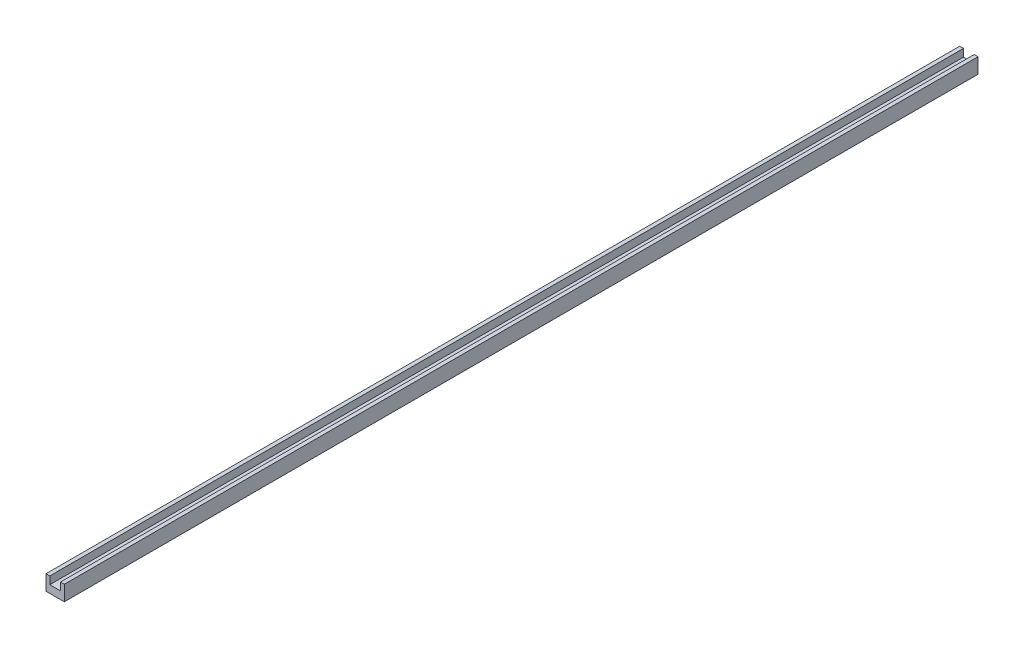
ISO-10303-21;
HEADER;
FILE_DESCRIPTION(('STEP AP214'),'2;1');
FILE_NAME('part.step','',(''),(''),'','','');
FILE_SCHEMA(('AUTOMOTIVE_DESIGN { 1 0 10303 214 1 1 1 1 }'));
ENDSEC;
DATA;
#1=APPLICATION_CONTEXT('core data for automotive mechanical design processes');
#2=APPLICATION_PROTOCOL_DEFINITION('international standard','automotive_design',2000,#1);
#3=PRODUCT_CONTEXT('',#1,'mechanical');
#4=PRODUCT('Part','Part','',(#3));
#5=PRODUCT_RELATED_PRODUCT_CATEGORY('part','',(#4));
#6=PRODUCT_DEFINITION_FORMATION('','',#4);
#7=PRODUCT_DEFINITION_CONTEXT('part definition',#1,'design');
#8=PRODUCT_DEFINITION('design','',#6,#7);
#9=PRODUCT_DEFINITION_SHAPE('','',#8);
#10=(LENGTH_UNIT() NAMED_UNIT(*) SI_UNIT(.MILLI.,.METRE.));
#11=(NAMED_UNIT(*) PLANE_ANGLE_UNIT() SI_UNIT($,.RADIAN.));
#12=(NAMED_UNIT(*) SI_UNIT($,.STERADIAN.) SOLID_ANGLE_UNIT());
#13=UNCERTAINTY_MEASURE_WITH_UNIT(LENGTH_MEASURE(1.E-05),#10,'distance_accuracy_value','');
#14=(GEOMETRIC_REPRESENTATION_CONTEXT(3) GLOBAL_UNCERTAINTY_ASSIGNED_CONTEXT((#13)) GLOBAL_UNIT_ASSIGNED_CONTEXT((#10,
#11,#12)) REPRESENTATION_CONTEXT('',''));
#15=CARTESIAN_POINT('',(0.,0.,0.));
#16=DIRECTION('',(0.,0.,1.));
#17=DIRECTION('',(1.,0.,0.));
#18=AXIS2_PLACEMENT_3D('',#15,#16,#17);
#19=CARTESIAN_POINT('',(0.,10.,600.));
#20=DIRECTION('',(0.,-1.,0.));
#21=DIRECTION('',(0.,0.,-1.));
#22=AXIS2_PLACEMENT_3D('',#19,#20,#21);
#23=PLANE('',#22);
#24=DIRECTION('',(0.,0.,1.));
#25=VECTOR('',#24,1.);
#26=CARTESIAN_POINT('',(9.5,10.,0.));
#27=LINE('',#26,#25);
#28=CARTESIAN_POINT('',(9.5,10.,0.));
#29=VERTEX_POINT('',#28);
#30=CARTESIAN_POINT('',(9.5,10.,600.));
#31=VERTEX_POINT('',#30);
#32=EDGE_CURVE('E108',#29,#31,#27,.T.);
#33=ORIENTED_EDGE('',*,*,#32,.T.);
#34=DIRECTION('',(-1.,0.,0.));
#35=VECTOR('',#34,1.);
#36=CARTESIAN_POINT('',(0.,10.,600.));
#37=LINE('',#36,#35);
#38=CARTESIAN_POINT('',(12.,10.,600.));
#39=VERTEX_POINT('',#38);
#40=EDGE_CURVE('E141',#39,#31,#37,.T.);
#41=ORIENTED_EDGE('',*,*,#40,.F.);
#42=DIRECTION('',(0.,0.,-1.));
#43=VECTOR('',#42,1.);
#44=CARTESIAN_POINT('',(12.,10.,600.));
#45=LINE('',#44,#43);
#46=CARTESIAN_POINT('',(12.,10.,0.));
#47=VERTEX_POINT('',#46);
#48=EDGE_CURVE('E131',#39,#47,#45,.T.);
#49=ORIENTED_EDGE('',*,*,#48,.T.);
#50=DIRECTION('',(-1.,0.,0.));
#51=VECTOR('',#50,1.);
#52=CARTESIAN_POINT('',(0.,10.,0.));
#53=LINE('',#52,#51);
#54=EDGE_CURVE('E124',#47,#29,#53,.T.);
#55=ORIENTED_EDGE('',*,*,#54,.T.);
#56=EDGE_LOOP('',(#33,#41,#49,#55));
#57=FACE_BOUND('',#56,.T.);
#58=ADVANCED_FACE('F33',(#57),#23,.F.);
#59=CARTESIAN_POINT('',(0.,0.,600.));
#60=DIRECTION('',(0.,0.,-1.));
#61=DIRECTION('',(-1.,0.,0.));
#62=AXIS2_PLACEMENT_3D('',#59,#60,#61);
#63=PLANE('',#62);
#64=DIRECTION('',(0.,-1.,0.));
#65=VECTOR('',#64,1.);
#66=CARTESIAN_POINT('',(9.5,0.,600.));
#67=LINE('',#66,#65);
#68=CARTESIAN_POINT('',(9.5,5.,600.));
#69=VERTEX_POINT('',#68);
#70=EDGE_CURVE('E113',#31,#69,#67,.T.);
#71=ORIENTED_EDGE('',*,*,#70,.T.);
#72=DIRECTION('',(1.,0.,0.));
#73=VECTOR('',#72,1.);
#74=CARTESIAN_POINT('',(0.,5.,600.));
#75=LINE('',#74,#73);
#76=CARTESIAN_POINT('',(2.5,5.,600.));
#77=VERTEX_POINT('',#76);
#78=EDGE_CURVE('E127',#77,#69,#75,.T.);
#79=ORIENTED_EDGE('',*,*,#78,.F.);
#80=DIRECTION('',(0.,-1.,0.));
#81=VECTOR('',#80,1.);
#82=CARTESIAN_POINT('',(2.5,0.,600.));
#83=LINE('',#82,#81);
#84=CARTESIAN_POINT('',(2.5,10.,600.));
#85=VERTEX_POINT('',#84);
#86=EDGE_CURVE('E163',#85,#77,#83,.T.);
#87=ORIENTED_EDGE('',*,*,#86,.F.);
#88=CARTESIAN_POINT('',(0.,10.,600.));
#89=VERTEX_POINT('',#88);
#90=EDGE_CURVE('E57',#85,#89,#37,.T.);
#91=ORIENTED_EDGE('',*,*,#90,.T.);
#92=DIRECTION('',(0.,-1.,0.));
#93=VECTOR('',#92,1.);
#94=CARTESIAN_POINT('',(0.,0.,600.));
#95=LINE('',#94,#93);
#96=CARTESIAN_POINT('',(0.,0.,600.));
#97=VERTEX_POINT('',#96);
#98=EDGE_CURVE('E132',#89,#97,#95,.T.);
#99=ORIENTED_EDGE('',*,*,#98,.T.);
#100=DIRECTION('',(1.,0.,0.));
#101=VECTOR('',#100,1.);
#102=CARTESIAN_POINT('',(0.,0.,600.));
#103=LINE('',#102,#101);
#104=CARTESIAN_POINT('',(12.,0.,600.));
#105=VERTEX_POINT('',#104);
#106=EDGE_CURVE('E86',#97,#105,#103,.T.);
#107=ORIENTED_EDGE('',*,*,#106,.T.);
#108=DIRECTION('',(0.,1.,0.));
#109=VECTOR('',#108,1.);
#110=CARTESIAN_POINT('',(12.,0.,600.));
#111=LINE('',#110,#109);
#112=EDGE_CURVE('E146',#105,#39,#111,.T.);
#113=ORIENTED_EDGE('',*,*,#112,.T.);
#114=ORIENTED_EDGE('',*,*,#40,.T.);
#115=EDGE_LOOP('',(#71,#79,#87,#91,#99,#107,#113,#114));
#116=FACE_BOUND('',#115,.T.);
#117=ADVANCED_FACE('F174',(#116),#63,.F.);
#118=CARTESIAN_POINT('',(0.,0.,0.));
#119=DIRECTION('',(0.,0.,-1.));
#120=DIRECTION('',(-1.,0.,0.));
#121=AXIS2_PLACEMENT_3D('',#118,#119,#120);
#122=PLANE('',#121);
#123=DIRECTION('',(1.,0.,0.));
#124=VECTOR('',#123,1.);
#125=CARTESIAN_POINT('',(0.,5.,0.));
#126=LINE('',#125,#124);
#127=CARTESIAN_POINT('',(2.5,5.,0.));
#128=VERTEX_POINT('',#127);
#129=CARTESIAN_POINT('',(9.5,5.,0.));
#130=VERTEX_POINT('',#129);
#131=EDGE_CURVE('E48',#128,#130,#126,.T.);
#132=ORIENTED_EDGE('',*,*,#131,.T.);
#133=DIRECTION('',(0.,-1.,0.));
#134=VECTOR('',#133,1.);
#135=CARTESIAN_POINT('',(9.5,0.,0.));
#136=LINE('',#135,#134);
#137=EDGE_CURVE('E111',#29,#130,#136,.T.);
#138=ORIENTED_EDGE('',*,*,#137,.F.);
#139=ORIENTED_EDGE('',*,*,#54,.F.);
#140=DIRECTION('',(0.,1.,0.));
#141=VECTOR('',#140,1.);
#142=CARTESIAN_POINT('',(12.,0.,0.));
#143=LINE('',#142,#141);
#144=CARTESIAN_POINT('',(12.,0.,0.));
#145=VERTEX_POINT('',#144);
#146=EDGE_CURVE('E135',#145,#47,#143,.T.);
#147=ORIENTED_EDGE('',*,*,#146,.F.);
#148=DIRECTION('',(1.,0.,0.));
#149=VECTOR('',#148,1.);
#150=CARTESIAN_POINT('',(0.,0.,0.));
#151=LINE('',#150,#149);
#152=CARTESIAN_POINT('',(0.,0.,0.));
#153=VERTEX_POINT('',#152);
#154=EDGE_CURVE('E148',#153,#145,#151,.T.);
#155=ORIENTED_EDGE('',*,*,#154,.F.);
#156=DIRECTION('',(0.,-1.,0.));
#157=VECTOR('',#156,1.);
#158=CARTESIAN_POINT('',(0.,0.,0.));
#159=LINE('',#158,#157);
#160=CARTESIAN_POINT('',(0.,10.,0.));
#161=VERTEX_POINT('',#160);
#162=EDGE_CURVE('E149',#161,#153,#159,.T.);
#163=ORIENTED_EDGE('',*,*,#162,.F.);
#164=CARTESIAN_POINT('',(2.5,10.,0.));
#165=VERTEX_POINT('',#164);
#166=EDGE_CURVE('E79',#165,#161,#53,.T.);
#167=ORIENTED_EDGE('',*,*,#166,.F.);
#168=DIRECTION('',(0.,-1.,0.));
#169=VECTOR('',#168,1.);
#170=CARTESIAN_POINT('',(2.5,0.,0.));
#171=LINE('',#170,#169);
#172=EDGE_CURVE('E126',#165,#128,#171,.T.);
#173=ORIENTED_EDGE('',*,*,#172,.T.);
#174=EDGE_LOOP('',(#132,#138,#139,#147,#155,#163,#167,#173));
#175=FACE_BOUND('',#174,.T.);
#176=ADVANCED_FACE('F122',(#175),#122,.T.);
#177=CARTESIAN_POINT('',(0.,0.,600.));
#178=DIRECTION('',(1.,0.,0.));
#179=DIRECTION('',(0.,1.,0.));
#180=AXIS2_PLACEMENT_3D('',#177,#178,#179);
#181=PLANE('',#180);
#182=ORIENTED_EDGE('',*,*,#162,.T.);
#183=DIRECTION('',(0.,0.,-1.));
#184=VECTOR('',#183,1.);
#185=CARTESIAN_POINT('',(0.,0.,600.));
#186=LINE('',#185,#184);
#187=EDGE_CURVE('E11',#97,#153,#186,.T.);
#188=ORIENTED_EDGE('',*,*,#187,.F.);
#189=ORIENTED_EDGE('',*,*,#98,.F.);
#190=DIRECTION('',(0.,0.,-1.));
#191=VECTOR('',#190,1.);
#192=CARTESIAN_POINT('',(0.,10.,600.));
#193=LINE('',#192,#191);
#194=EDGE_CURVE('E139',#89,#161,#193,.T.);
#195=ORIENTED_EDGE('',*,*,#194,.T.);
#196=EDGE_LOOP('',(#182,#188,#189,#195));
#197=FACE_BOUND('',#196,.T.);
#198=ADVANCED_FACE('F35',(#197),#181,.F.);
#199=CARTESIAN_POINT('',(0.,0.,600.));
#200=DIRECTION('',(0.,1.,0.));
#201=DIRECTION('',(0.,0.,1.));
#202=AXIS2_PLACEMENT_3D('',#199,#200,#201);
#203=PLANE('',#202);
#204=ORIENTED_EDGE('',*,*,#154,.T.);
#205=DIRECTION('',(0.,0.,-1.));
#206=VECTOR('',#205,1.);
#207=CARTESIAN_POINT('',(12.,0.,600.));
#208=LINE('',#207,#206);
#209=EDGE_CURVE('E41',#105,#145,#208,.T.);
#210=ORIENTED_EDGE('',*,*,#209,.F.);
#211=ORIENTED_EDGE('',*,*,#106,.F.);
#212=ORIENTED_EDGE('',*,*,#187,.T.);
#213=EDGE_LOOP('',(#204,#210,#211,#212));
#214=FACE_BOUND('',#213,.T.);
#215=ADVANCED_FACE('F197',(#214),#203,.F.);
#216=CARTESIAN_POINT('',(12.,0.,600.));
#217=DIRECTION('',(-1.,0.,0.));
#218=DIRECTION('',(0.,0.,1.));
#219=AXIS2_PLACEMENT_3D('',#216,#217,#218);
#220=PLANE('',#219);
#221=ORIENTED_EDGE('',*,*,#146,.T.);
#222=ORIENTED_EDGE('',*,*,#48,.F.);
#223=ORIENTED_EDGE('',*,*,#112,.F.);
#224=ORIENTED_EDGE('',*,*,#209,.T.);
#225=EDGE_LOOP('',(#221,#222,#223,#224));
#226=FACE_BOUND('',#225,.T.);
#227=ADVANCED_FACE('F145',(#226),#220,.F.);
#228=ORIENTED_EDGE('',*,*,#90,.F.);
#229=DIRECTION('',(0.,0.,1.));
#230=VECTOR('',#229,1.);
#231=CARTESIAN_POINT('',(2.5,10.,0.));
#232=LINE('',#231,#230);
#233=EDGE_CURVE('E118',#165,#85,#232,.T.);
#234=ORIENTED_EDGE('',*,*,#233,.F.);
#235=ORIENTED_EDGE('',*,*,#166,.T.);
#236=ORIENTED_EDGE('',*,*,#194,.F.);
#237=EDGE_LOOP('',(#228,#234,#235,#236));
#238=FACE_BOUND('',#237,.T.);
#239=ADVANCED_FACE('F170',(#238),#23,.F.);
#240=CARTESIAN_POINT('',(9.5,0.,0.));
#241=DIRECTION('',(-1.,0.,0.));
#242=DIRECTION('',(0.,0.,1.));
#243=AXIS2_PLACEMENT_3D('',#240,#241,#242);
#244=PLANE('',#243);
#245=ORIENTED_EDGE('',*,*,#70,.F.);
#246=ORIENTED_EDGE('',*,*,#32,.F.);
#247=ORIENTED_EDGE('',*,*,#137,.T.);
#248=DIRECTION('',(0.,0.,1.));
#249=VECTOR('',#248,1.);
#250=CARTESIAN_POINT('',(9.5,5.,0.));
#251=LINE('',#250,#249);
#252=EDGE_CURVE('E151',#130,#69,#251,.T.);
#253=ORIENTED_EDGE('',*,*,#252,.T.);
#254=EDGE_LOOP('',(#245,#246,#247,#253));
#255=FACE_BOUND('',#254,.T.);
#256=ADVANCED_FACE('F110',(#255),#244,.T.);
#257=CARTESIAN_POINT('',(0.,5.,0.));
#258=DIRECTION('',(0.,-1.,0.));
#259=DIRECTION('',(1.,0.,0.));
#260=AXIS2_PLACEMENT_3D('',#257,#258,#259);
#261=PLANE('',#260);
#262=ORIENTED_EDGE('',*,*,#78,.T.);
#263=ORIENTED_EDGE('',*,*,#252,.F.);
#264=ORIENTED_EDGE('',*,*,#131,.F.);
#265=DIRECTION('',(0.,0.,1.));
#266=VECTOR('',#265,1.);
#267=CARTESIAN_POINT('',(2.5,5.,0.));
#268=LINE('',#267,#266);
#269=EDGE_CURVE('E158',#128,#77,#268,.T.);
#270=ORIENTED_EDGE('',*,*,#269,.T.);
#271=EDGE_LOOP('',(#262,#263,#264,#270));
#272=FACE_BOUND('',#271,.T.);
#273=ADVANCED_FACE('F176',(#272),#261,.F.);
#274=CARTESIAN_POINT('',(2.5,0.,0.));
#275=DIRECTION('',(-1.,0.,0.));
#276=DIRECTION('',(0.,-1.,0.));
#277=AXIS2_PLACEMENT_3D('',#274,#275,#276);
#278=PLANE('',#277);
#279=ORIENTED_EDGE('',*,*,#86,.T.);
#280=ORIENTED_EDGE('',*,*,#269,.F.);
#281=ORIENTED_EDGE('',*,*,#172,.F.);
#282=ORIENTED_EDGE('',*,*,#233,.T.);
#283=EDGE_LOOP('',(#279,#280,#281,#282));
#284=FACE_BOUND('',#283,.T.);
#285=ADVANCED_FACE('F169',(#284),#278,.F.);
#286=CLOSED_SHELL('',(#58,#117,#176,#198,#215,#227,#239,#256,#273,#285));
#287=MANIFOLD_SOLID_BREP('B2',#286);
#288=ADVANCED_BREP_SHAPE_REPRESENTATION('',(#18,#287),#14);
#289=SHAPE_DEFINITION_REPRESENTATION(#9,#288);
ENDSEC;
END-ISO-10303-21;
